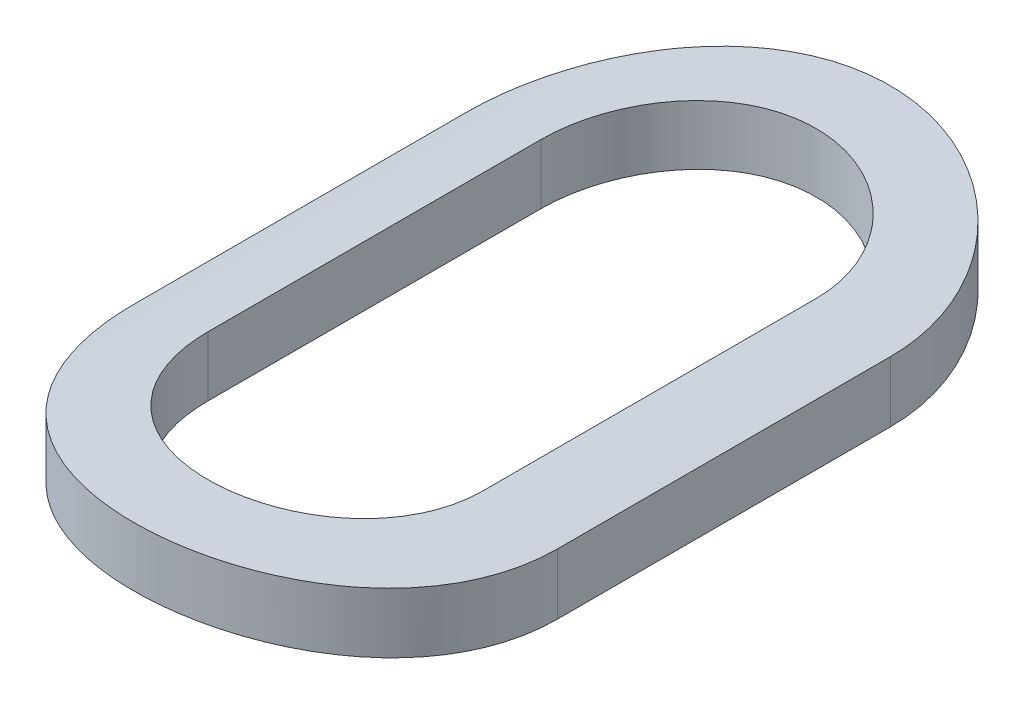
ISO-10303-21;
HEADER;
FILE_DESCRIPTION(('STEP AP214'),'2;1');
FILE_NAME('part.step','',(''),(''),'','','');
FILE_SCHEMA(('AUTOMOTIVE_DESIGN { 1 0 10303 214 1 1 1 1 }'));
ENDSEC;
DATA;
#1=APPLICATION_CONTEXT('core data for automotive mechanical design processes');
#2=APPLICATION_PROTOCOL_DEFINITION('international standard','automotive_design',2000,#1);
#3=PRODUCT_CONTEXT('',#1,'mechanical');
#4=PRODUCT('Part','Part','',(#3));
#5=PRODUCT_RELATED_PRODUCT_CATEGORY('part','',(#4));
#6=PRODUCT_DEFINITION_FORMATION('','',#4);
#7=PRODUCT_DEFINITION_CONTEXT('part definition',#1,'design');
#8=PRODUCT_DEFINITION('design','',#6,#7);
#9=PRODUCT_DEFINITION_SHAPE('','',#8);
#10=(LENGTH_UNIT() NAMED_UNIT(*) SI_UNIT(.MILLI.,.METRE.));
#11=(NAMED_UNIT(*) PLANE_ANGLE_UNIT() SI_UNIT($,.RADIAN.));
#12=(NAMED_UNIT(*) SI_UNIT($,.STERADIAN.) SOLID_ANGLE_UNIT());
#13=UNCERTAINTY_MEASURE_WITH_UNIT(LENGTH_MEASURE(1.E-05),#10,'distance_accuracy_value','');
#14=(GEOMETRIC_REPRESENTATION_CONTEXT(3) GLOBAL_UNCERTAINTY_ASSIGNED_CONTEXT((#13)) GLOBAL_UNIT_ASSIGNED_CONTEXT((#10,
#11,#12)) REPRESENTATION_CONTEXT('',''));
#15=CARTESIAN_POINT('',(0.,0.,0.));
#16=DIRECTION('',(0.,0.,1.));
#17=DIRECTION('',(1.,0.,0.));
#18=AXIS2_PLACEMENT_3D('',#15,#16,#17);
#19=CARTESIAN_POINT('',(-75.4181941684126,-39.6644186635389,0.584683614855494));
#20=DIRECTION('',(0.,0.,1.));
#21=DIRECTION('',(1.,0.,0.));
#22=AXIS2_PLACEMENT_3D('',#19,#20,#21);
#23=CYLINDRICAL_SURFACE('',#22,2.00000000000003);
#24=CARTESIAN_POINT('',(-75.6966157953255,-37.6838931278118,1.52614089397216));
#25=CARTESIAN_POINT('',(-75.6966294551295,-37.6839002867788,1.51055790257619));
#26=CARTESIAN_POINT('',(-75.6953084060336,-37.6837094101403,1.49498060774954));
#27=CARTESIAN_POINT('',(-75.6900997223513,-37.682984903865,1.46428675744976));
#28=CARTESIAN_POINT('',(-75.6862150067653,-37.682451664063,1.4491696984053));
#29=CARTESIAN_POINT('',(-75.6759798910917,-37.681095325679,1.41980396078942));
#30=CARTESIAN_POINT('',(-75.6696287659323,-37.6802721418662,1.40555553900531));
#31=CARTESIAN_POINT('',(-75.6546490646654,-37.6784312018188,1.37832682417251));
#32=CARTESIAN_POINT('',(-75.6460206019817,-37.6774134552751,1.36534646801138));
#33=CARTESIAN_POINT('',(-75.6266675065483,-37.6752897558642,1.34093397913916));
#34=CARTESIAN_POINT('',(-75.6159304559895,-37.6741833046273,1.32951173265973));
#35=CARTESIAN_POINT('',(-75.5926907558505,-37.6720113462003,1.308623829781));
#36=CARTESIAN_POINT('',(-75.580187837307,-37.6709458452788,1.29915847198194));
#37=CARTESIAN_POINT('',(-75.553708465243,-37.6689706990596,1.28241807527079));
#38=CARTESIAN_POINT('',(-75.5397261782164,-37.6680617109434,1.27515217939641));
#39=CARTESIAN_POINT('',(-75.5107258272774,-37.6665076298967,1.2630759585231));
#40=CARTESIAN_POINT('',(-75.4957078713967,-37.6658625094904,1.25826537784642));
#41=CARTESIAN_POINT('',(-75.4651646944313,-37.6649123258311,1.25126591825545));
#42=CARTESIAN_POINT('',(-75.4496433779763,-37.6646050922705,1.24906030034948));
#43=CARTESIAN_POINT('',(-75.4184477239863,-37.6643578699444,1.24728143324666));
#44=CARTESIAN_POINT('',(-75.4027733901594,-37.6644178723014,1.24770812041699));
#45=CARTESIAN_POINT('',(-75.3718315278119,-37.6648966308364,1.25116854477548));
#46=CARTESIAN_POINT('',(-75.3565619335515,-37.6653128992251,1.25418420374455));
#47=CARTESIAN_POINT('',(-75.3267477544281,-37.6664546352049,1.26270862594779));
#48=CARTESIAN_POINT('',(-75.3122031819229,-37.6671801080642,1.26821743166021));
#49=CARTESIAN_POINT('',(-75.2841962757678,-37.6688630418128,1.28159072517154));
#50=CARTESIAN_POINT('',(-75.2707376908188,-37.66982126401,1.28946296396958));
#51=CARTESIAN_POINT('',(-75.2453263231457,-37.6718626513786,1.30733365677506));
#52=CARTESIAN_POINT('',(-75.233373564732,-37.6729458185666,1.31733214510205));
#53=CARTESIAN_POINT('',(-75.2112075527389,-37.6751268689559,1.33927107507362));
#54=CARTESIAN_POINT('',(-75.2010096555949,-37.676224799518,1.35122703325541));
#55=CARTESIAN_POINT('',(-75.1827599571932,-37.678302991191,1.37669276554793));
#56=CARTESIAN_POINT('',(-75.1747087848961,-37.6792832177701,1.39020299338218));
#57=CARTESIAN_POINT('',(-75.160978686353,-37.6810155063499,1.41841293060073));
#58=CARTESIAN_POINT('',(-75.1553025839182,-37.6817672964648,1.43311403122397));
#59=CARTESIAN_POINT('',(-75.1465149521259,-37.6829517101126,1.46325601699249));
#60=CARTESIAN_POINT('',(-75.1433995707512,-37.6833848129343,1.47869575386591));
#61=CARTESIAN_POINT('',(-75.1403810235822,-37.6838079660354,1.50485861165102));
#62=CARTESIAN_POINT('',(-75.1397671156949,-37.6838956949834,1.5155021196223));
#63=CARTESIAN_POINT('',(-75.1397725414866,-37.6838931278136,1.52614089397216));
#64=B_SPLINE_CURVE_WITH_KNOTS('',3,(#24,#25,#26,#27,#28,#29,#30,#31,#32,#33,#34,#35,#36,#37,#38,
#39,#40,#41,#42,#43,#44,#45,#46,#47,#48,#49,#50,#51,#52,#53,#54,#55,#56,#57,#58,#59,#60,#61,#62,
#63),.UNSPECIFIED.,.F.,.F.,(4,2,2,2,2,2,2,2,2,2,2,2,2,2,2,2,2,2,2,4),(0.,0.046683445205683,
0.0933138279590832,0.139957929441397,0.186599708232392,0.233524883020567,0.280457212811403,
0.327582040016522,0.374701959000845,0.421517417926936,0.468331745150025,0.514821812645198,
0.561312672268412,0.607957698215604,0.65460347711198,0.701638704811785,0.748687698077968,
0.79579247182685,0.842826256899453,0.874737605827836),.UNSPECIFIED.);
#65=CARTESIAN_POINT('',(-75.6966157953255,-37.6838931278117,1.52614089397216));
#66=VERTEX_POINT('',#65);
#67=CARTESIAN_POINT('',(-75.1397725414866,-37.6838931278136,1.52614089397216));
#68=VERTEX_POINT('',#67);
#69=EDGE_CURVE('E173',#66,#68,#64,.T.);
#70=ORIENTED_EDGE('',*,*,#69,.T.);
#71=DIRECTION('',(0.,0.,1.));
#72=VECTOR('',#71,1.);
#73=CARTESIAN_POINT('',(-75.1397725414866,-37.6838931278136,1.52614089397216));
#74=LINE('',#73,#72);
#75=CARTESIAN_POINT('',(-75.1397725414866,-37.6838931278136,2.19965606593906));
#76=VERTEX_POINT('',#75);
#77=EDGE_CURVE('E111',#76,#68,#74,.F.);
#78=ORIENTED_EDGE('',*,*,#77,.F.);
#79=CARTESIAN_POINT('',(-75.1397725414866,-37.6838931278136,2.19965606593906));
#80=CARTESIAN_POINT('',(-75.1397588796207,-37.6839002866824,2.21523901509953));
#81=CARTESIAN_POINT('',(-75.1410799225853,-37.6837094111274,2.23081626779047));
#82=CARTESIAN_POINT('',(-75.1462885944889,-37.6829849067766,2.26151012045989));
#83=CARTESIAN_POINT('',(-75.1501733182881,-37.6824516659645,2.27662722161692));
#84=CARTESIAN_POINT('',(-75.1604085498956,-37.6810953115339,2.30599330416705));
#85=CARTESIAN_POINT('',(-75.1667598272963,-37.680272107451,2.32024201300512));
#86=CARTESIAN_POINT('',(-75.1817396397894,-37.6784311594776,2.34747067805799));
#87=CARTESIAN_POINT('',(-75.1903679668946,-37.6774134333571,2.36045075000263));
#88=CARTESIAN_POINT('',(-75.2097197306448,-37.6752898729645,2.38486162852106));
#89=CARTESIAN_POINT('',(-75.2204553998979,-37.674183547727,2.39628269569915));
#90=CARTESIAN_POINT('',(-75.2436949315732,-37.6720115826156,2.41717105052032));
#91=CARTESIAN_POINT('',(-75.2561994511821,-37.6709459580511,2.42663760876867));
#92=CARTESIAN_POINT('',(-75.2826865812824,-37.6689701638389,2.44338334394182));
#93=CARTESIAN_POINT('',(-75.2966756305399,-37.6680607202235,2.45065241840277));
#94=CARTESIAN_POINT('',(-75.3256802616352,-37.6665069471062,2.46272636573324));
#95=CARTESIAN_POINT('',(-75.3406946165842,-37.6658623070036,2.46753412723606));
#96=CARTESIAN_POINT('',(-75.3661906867543,-37.6650687404204,2.47337812352537));
#97=CARTESIAN_POINT('',(-75.3765094630458,-37.6648261366692,2.47513790630006));
#98=CARTESIAN_POINT('',(-75.3972820582867,-37.6645010155628,2.4774879232557));
#99=CARTESIAN_POINT('',(-75.4077358788047,-37.6644185000687,2.47807814384027));
#100=CARTESIAN_POINT('',(-75.4337519183814,-37.6644189067171,2.47807702197812));
#101=CARTESIAN_POINT('',(-75.4493195582294,-37.6646021145815,2.4767692225089));
#102=CARTESIAN_POINT('',(-75.4800209223931,-37.6653153707963,2.47157324468419));
#103=CARTESIAN_POINT('',(-75.4951541758997,-37.6658457816674,2.46768236923318));
#104=CARTESIAN_POINT('',(-75.524537296991,-37.6671937576897,2.45743806412362));
#105=CARTESIAN_POINT('',(-75.5387878109929,-37.6680111097223,2.45108646174868));
#106=CARTESIAN_POINT('',(-75.5660183827943,-37.6698423970419,2.43610502344558));
#107=CARTESIAN_POINT('',(-75.5789986259308,-37.6708563035864,2.42747552055259));
#108=CARTESIAN_POINT('',(-75.6034100675533,-37.6729753872155,2.40812130142739));
#109=CARTESIAN_POINT('',(-75.6148314615178,-37.6740810774153,2.3973842743982));
#110=CARTESIAN_POINT('',(-75.6357169845139,-37.6762550992279,2.37414528489898));
#111=CARTESIAN_POINT('',(-75.6451809299362,-37.6773234273283,2.36164315704675));
#112=CARTESIAN_POINT('',(-75.6619217538811,-37.6793069555814,2.33516253507374));
#113=CARTESIAN_POINT('',(-75.6691886877188,-37.6802214513813,2.32117770377687));
#114=CARTESIAN_POINT('',(-75.6812636393248,-37.6817861316722,2.29217326491074));
#115=CARTESIAN_POINT('',(-75.6860730762994,-37.6824364686703,2.27715426027747));
#116=CARTESIAN_POINT('',(-75.691918595569,-37.6832370693846,2.25164765166141));
#117=CARTESIAN_POINT('',(-75.6936785663991,-37.6834818214154,2.24132309798971));
#118=CARTESIAN_POINT('',(-75.6960272293276,-37.6838103779396,2.22055259136692));
#119=CARTESIAN_POINT('',(-75.6966174212662,-37.6838943885239,2.21010681116455));
#120=CARTESIAN_POINT('',(-75.6966157953255,-37.6838931278118,2.19965606593906));
#121=B_SPLINE_CURVE_WITH_KNOTS('',3,(#79,#80,#81,#82,#83,#84,#85,#86,#87,#88,#89,#90,#91,#92,
#93,#94,#95,#96,#97,#98,#99,#100,#101,#102,#103,#104,#105,#106,#107,#108,#109,#110,#111,#112,
#113,#114,#115,#116,#117,#118,#119,#120),.UNSPECIFIED.,.F.,.F.,(4,2,2,2,2,2,2,2,2,2,2,2,2,2,2,2,
2,2,2,2,4),(0.,0.0466833192223591,0.0933138279618848,0.139958897647061,0.186599708214385,
0.233519721309547,0.280457212757858,0.327607317912904,0.374701959415365,0.40605073459515,
0.437399874208021,0.48403484939351,0.530718594814154,0.577367740117317,0.624010068963722,
0.670933427045885,0.717861184561648,0.764998283537731,0.812108129951289,0.843474060832563,
0.87479974958086),.UNSPECIFIED.);
#122=CARTESIAN_POINT('',(-75.6966157953255,-37.6838931278117,2.19965606593906));
#123=VERTEX_POINT('',#122);
#124=EDGE_CURVE('E118',#76,#123,#121,.T.);
#125=ORIENTED_EDGE('',*,*,#124,.T.);
#126=DIRECTION('',(0.,0.,-1.));
#127=VECTOR('',#126,1.);
#128=CARTESIAN_POINT('',(-75.6966157953255,-37.6838931278117,2.19965606593906));
#129=LINE('',#128,#127);
#130=EDGE_CURVE('E115',#66,#123,#129,.F.);
#131=ORIENTED_EDGE('',*,*,#130,.F.);
#132=EDGE_LOOP('',(#70,#78,#125,#131));
#133=FACE_BOUND('',#132,.T.);
#134=DIRECTION('',(0.,0.,1.));
#135=VECTOR('',#134,1.);
#136=CARTESIAN_POINT('',(-75.8466157953255,-37.7108437585011,1.52614085880568));
#137=LINE('',#136,#135);
#138=CARTESIAN_POINT('',(-75.8466157953255,-37.7108437585011,2.19965610042257));
#139=VERTEX_POINT('',#138);
#140=CARTESIAN_POINT('',(-75.8466157953255,-37.7108437585011,1.52614088518054));
#141=VERTEX_POINT('',#140);
#142=EDGE_CURVE('E98',#139,#141,#137,.F.);
#143=ORIENTED_EDGE('',*,*,#142,.F.);
#144=CARTESIAN_POINT('',(-74.9897725414865,-37.710843758504,2.1996560835223));
#145=CARTESIAN_POINT('',(-74.9897507874872,-37.7108609265628,2.22346462687602));
#146=CARTESIAN_POINT('',(-74.9917557491165,-37.7104089707995,2.24726069993954));
#147=CARTESIAN_POINT('',(-74.999650902421,-37.7086961520659,2.29413004413154));
#148=CARTESIAN_POINT('',(-75.0055345436485,-37.7074366530006,2.31720446531217));
#149=CARTESIAN_POINT('',(-75.0210204579143,-37.7042371635132,2.36201895786152));
#150=CARTESIAN_POINT('',(-75.0306230085622,-37.7022971222908,2.38375892947569));
#151=CARTESIAN_POINT('',(-75.0532571160442,-37.6979614029511,2.42532356760174));
#152=CARTESIAN_POINT('',(-75.0662890477629,-37.6955656750281,2.44514802439392));
#153=CARTESIAN_POINT('',(-75.0956349864136,-37.690544432848,2.48263206652445));
#154=CARTESIAN_POINT('',(-75.1119933672644,-37.6879161167228,2.50025654152804));
#155=CARTESIAN_POINT('',(-75.1474378541796,-37.6827498539249,2.53253869880141));
#156=CARTESIAN_POINT('',(-75.1665249471919,-37.6802119403665,2.54719530296686));
#157=CARTESIAN_POINT('',(-75.2071251883386,-37.6754813678396,2.57326437579633));
#158=CARTESIAN_POINT('',(-75.2286616387265,-37.6732926006761,2.58464128255465));
#159=CARTESIAN_POINT('',(-75.2733799678486,-37.6695426855915,2.60358949416117));
#160=CARTESIAN_POINT('',(-75.2965598533901,-37.6679807922026,2.61116532188668));
#161=CARTESIAN_POINT('',(-75.3362486728264,-37.6660333465672,2.620490739329));
#162=CARTESIAN_POINT('',(-75.3524990546746,-37.6654308897503,2.62333125293238));
#163=CARTESIAN_POINT('',(-75.3852287367011,-37.6646233603424,2.62712508436784));
#164=CARTESIAN_POINT('',(-75.4017080360753,-37.6644182863556,2.6280784088279));
#165=CARTESIAN_POINT('',(-75.4419623491601,-37.6644192073268,2.62807666064007));
#166=CARTESIAN_POINT('',(-75.4657447323547,-37.6648467855909,2.62609263579518));
#167=CARTESIAN_POINT('',(-75.5126388085993,-37.6665116653701,2.61821519157517));
#168=CARTESIAN_POINT('',(-75.5357498150832,-37.6677497672734,2.61231790779678));
#169=CARTESIAN_POINT('',(-75.5806103014741,-37.6708976140934,2.59680665002691));
#170=CARTESIAN_POINT('',(-75.6023612917017,-37.6728065977997,2.58719688714658));
#171=CARTESIAN_POINT('',(-75.6439403691954,-37.6770897814008,2.56454559258032));
#172=CARTESIAN_POINT('',(-75.663768588751,-37.6794639492563,2.55150429721851));
#173=CARTESIAN_POINT('',(-75.7012470539439,-37.684458088384,2.52214724432785));
#174=CARTESIAN_POINT('',(-75.7188634133386,-37.6870810031852,2.50578872494364));
#175=CARTESIAN_POINT('',(-75.75112514488,-37.6922562593745,2.47035190925136));
#176=CARTESIAN_POINT('',(-75.7657701321695,-37.6948085915837,2.45127326117166));
#177=CARTESIAN_POINT('',(-75.7918237217925,-37.6995830774688,2.41068672079407));
#178=CARTESIAN_POINT('',(-75.8031955772303,-37.7018013582123,2.38915476932303));
#179=CARTESIAN_POINT('',(-75.822140978803,-37.7056126660641,2.34443429895392));
#180=CARTESIAN_POINT('',(-75.8297170999801,-37.7072061168997,2.32124691534171));
#181=CARTESIAN_POINT('',(-75.8390384702135,-37.7091936050441,2.28155055938063));
#182=CARTESIAN_POINT('',(-75.8418763753409,-37.7098087541299,2.26530087047552));
#183=CARTESIAN_POINT('',(-75.8456657770817,-37.7106354008836,2.23258885983498));
#184=CARTESIAN_POINT('',(-75.8466190711686,-37.7108472831656,2.21612675579508));
#185=CARTESIAN_POINT('',(-75.8466157953254,-37.7108437585011,2.19965610042257));
#186=B_SPLINE_CURVE_WITH_KNOTS('',3,(#144,#145,#146,#147,#148,#149,#150,#151,#152,#153,#154,
#155,#156,#157,#158,#159,#160,#161,#162,#163,#164,#165,#166,#167,#168,#169,#170,#171,#172,#173,
#174,#175,#176,#177,#178,#179,#180,#181,#182,#183,#184,#185),.UNSPECIFIED.,.F.,.F.,(4,2,2,2,2,2,
2,2,2,2,2,2,2,2,2,2,2,2,2,2,4),(0.,0.0713180928670392,0.142516048786507,0.21371932052547,
0.284930379125408,0.357162329816575,0.429420472492321,0.502434936871074,0.575362314580175,
0.624778709813895,0.674194931492182,0.745438669287502,0.816752866276428,0.887986407082011,
0.959215043431966,1.03142804918488,1.10365040213046,1.17665449944606,1.24960900318434,
1.29902300932562,1.34838986340816),.UNSPECIFIED.);
#187=CARTESIAN_POINT('',(-74.9897725414866,-37.710843758504,2.19965607473068));
#188=VERTEX_POINT('',#187);
#189=EDGE_CURVE('E21',#188,#139,#186,.T.);
#190=ORIENTED_EDGE('',*,*,#189,.F.);
#191=DIRECTION('',(0.,0.,-1.));
#192=VECTOR('',#191,1.);
#193=CARTESIAN_POINT('',(-74.9897725414866,-37.7108437585039,2.19965610110554));
#194=LINE('',#193,#192);
#195=CARTESIAN_POINT('',(-74.9897725414866,-37.710843758504,1.52614086018544));
#196=VERTEX_POINT('',#195);
#197=EDGE_CURVE('E85',#196,#188,#194,.F.);
#198=ORIENTED_EDGE('',*,*,#197,.F.);
#199=CARTESIAN_POINT('',(-75.8466157953255,-37.7108437585011,1.52614087638892));
#200=CARTESIAN_POINT('',(-75.8466375462383,-37.710860926741,1.50233229684094));
#201=CARTESIAN_POINT('',(-75.8446325800499,-37.710408969512,1.47853618762487));
#202=CARTESIAN_POINT('',(-75.8367374180647,-37.7086961481775,1.43166684544541));
#203=CARTESIAN_POINT('',(-75.8308537844985,-37.7074366504302,1.40859246035907));
#204=CARTESIAN_POINT('',(-75.815368021635,-37.7042371937784,1.36377842428043));
#205=CARTESIAN_POINT('',(-75.8057656791143,-37.7022971958559,1.3420388499064));
#206=CARTESIAN_POINT('',(-75.7831317253111,-37.697961493391,1.30047414373827));
#207=CARTESIAN_POINT('',(-75.7700996100327,-37.6955657218882,1.28064929389361));
#208=CARTESIAN_POINT('',(-75.7407517754949,-37.6905441715474,1.24316293410271));
#209=CARTESIAN_POINT('',(-75.7243914109984,-37.6879155738663,1.22553674701704));
#210=CARTESIAN_POINT('',(-75.6889466889083,-37.6827493250895,1.1932552363273));
#211=CARTESIAN_POINT('',(-75.6698619071841,-37.6802116882315,1.17860037615362));
#212=CARTESIAN_POINT('',(-75.6292730690832,-37.6754826039508,1.15253928629161));
#213=CARTESIAN_POINT('',(-75.6077466269489,-37.6732948919729,1.14116718492193));
#214=CARTESIAN_POINT('',(-75.5630347833723,-37.6695442824693,1.12221560182122));
#215=CARTESIAN_POINT('',(-75.5398496490479,-37.6679812846045,1.11463551098418));
#216=CARTESIAN_POINT('',(-75.4928474837554,-37.6656760727888,1.10359390922774));
#217=CARTESIAN_POINT('',(-75.4690451959955,-37.6649218707293,1.10007218422251));
#218=CARTESIAN_POINT('',(-75.4211759451345,-37.6642777190988,1.09705909600418));
#219=CARTESIAN_POINT('',(-75.397109005236,-37.6643876943566,1.09756738223824));
#220=CARTESIAN_POINT('',(-75.3498095537472,-37.6654503456381,1.1025549901147));
#221=CARTESIAN_POINT('',(-75.3265698337533,-37.6663892293919,1.10696932148018));
#222=CARTESIAN_POINT('',(-75.2811690561258,-37.6689885160083,1.11954022663475));
#223=CARTESIAN_POINT('',(-75.259008037602,-37.6706489450101,1.12769693599777));
#224=CARTESIAN_POINT('',(-75.2162115567761,-37.6745271051459,1.14757936300613));
#225=CARTESIAN_POINT('',(-75.195588024803,-37.6767487041271,1.15932997516693));
#226=CARTESIAN_POINT('',(-75.1565823887012,-37.6815051641751,1.18604774260607));
#227=CARTESIAN_POINT('',(-75.1382005116553,-37.6840400569267,1.20101522333448));
#228=CARTESIAN_POINT('',(-75.103814917621,-37.6892036380501,1.23409444378062));
#229=CARTESIAN_POINT('',(-75.0878656656595,-37.6918331894257,1.25226271237701));
#230=CARTESIAN_POINT('',(-75.0592267773114,-37.6968428248062,1.29104802299348));
#231=CARTESIAN_POINT('',(-75.0465380362665,-37.6992228401823,1.31166573536689));
#232=CARTESIAN_POINT('',(-75.0247552174354,-37.703467582625,1.35485721119513));
#233=CARTESIAN_POINT('',(-75.0156731178673,-37.7053305865483,1.37743719403201));
#234=CARTESIAN_POINT('',(-75.0014654306675,-37.7083017923708,1.42382636338776));
#235=CARTESIAN_POINT('',(-74.9963339512501,-37.7094111179819,1.4476336627376));
#236=CARTESIAN_POINT('',(-74.9909289025459,-37.7105911114106,1.48975325475553));
#237=CARTESIAN_POINT('',(-74.9897608957576,-37.7108522538644,1.50794944552493));
#238=CARTESIAN_POINT('',(-74.9897725414865,-37.7108437585039,1.52614086018544));
#239=B_SPLINE_CURVE_WITH_KNOTS('',3,(#199,#200,#201,#202,#203,#204,#205,#206,#207,#208,#209,
#210,#211,#212,#213,#214,#215,#216,#217,#218,#219,#220,#221,#222,#223,#224,#225,#226,#227,#228,
#229,#230,#231,#232,#233,#234,#235,#236,#237,#238),.UNSPECIFIED.,.F.,.F.,(4,2,2,2,2,2,2,2,2,2,2,
2,2,2,2,2,2,2,2,4),(0.,0.0713182009212712,0.142516048781537,0.213717979592351,0.284930379185427,
0.357169796743248,0.429420472648854,0.502397255709576,0.575362312831925,0.647230251696669,
0.719091939156239,0.789779986054087,0.860470593947563,0.931662403758348,1.0028614194265,
1.0754740946787,1.14810668823571,1.22097852800716,1.29374147817563,1.34829217205202),.UNSPECIFIED.);
#240=EDGE_CURVE('E99',#141,#196,#239,.T.);
#241=ORIENTED_EDGE('',*,*,#240,.F.);
#242=EDGE_LOOP('',(#143,#190,#198,#241));
#243=FACE_BOUND('',#242,.T.);
#244=ADVANCED_FACE('F17',(#133,#243),#23,.T.);
#245=CARTESIAN_POINT('',(-75.8466157953255,-36.7841716842097,1.52614085880568));
#246=DIRECTION('',(-1.,0.,0.));
#247=DIRECTION('',(0.,0.,1.));
#248=AXIS2_PLACEMENT_3D('',#245,#246,#247);
#249=PLANE('',#248);
#250=ORIENTED_EDGE('',*,*,#142,.T.);
#251=DIRECTION('',(0.,1.,0.));
#252=VECTOR('',#251,1.);
#253=CARTESIAN_POINT('',(-75.8466157953255,-36.7841716842097,1.52614087638892));
#254=LINE('',#253,#252);
#255=CARTESIAN_POINT('',(-75.8466157953255,-37.8338846131609,1.52614088518054));
#256=VERTEX_POINT('',#255);
#257=EDGE_CURVE('E168',#256,#141,#254,.T.);
#258=ORIENTED_EDGE('',*,*,#257,.F.);
#259=DIRECTION('',(0.,0.,1.));
#260=VECTOR('',#259,1.);
#261=CARTESIAN_POINT('',(-75.8466157953255,-37.8338846131609,0.584683614855494));
#262=LINE('',#261,#260);
#263=CARTESIAN_POINT('',(-75.8466157953254,-37.8338846131609,2.19965610042257));
#264=VERTEX_POINT('',#263);
#265=EDGE_CURVE('E106',#256,#264,#262,.T.);
#266=ORIENTED_EDGE('',*,*,#265,.T.);
#267=DIRECTION('',(0.,1.,0.));
#268=VECTOR('',#267,1.);
#269=CARTESIAN_POINT('',(-75.8466157953254,-36.7841716842097,2.19965610042257));
#270=LINE('',#269,#268);
#271=EDGE_CURVE('E93',#139,#264,#270,.F.);
#272=ORIENTED_EDGE('',*,*,#271,.F.);
#273=EDGE_LOOP('',(#250,#258,#266,#272));
#274=FACE_BOUND('',#273,.T.);
#275=ADVANCED_FACE('F105',(#274),#249,.T.);
#276=CARTESIAN_POINT('',(-75.418194168406,-36.7841716842097,2.19965606593906));
#277=DIRECTION('',(0.,1.,0.));
#278=DIRECTION('',(0.,0.,1.));
#279=AXIS2_PLACEMENT_3D('',#276,#277,#278);
#280=CYLINDRICAL_SURFACE('',#279,0.428421626919453);
#281=DIRECTION('',(0.,1.,0.));
#282=VECTOR('',#281,1.);
#283=CARTESIAN_POINT('',(-74.9897725414866,-36.7841716842097,2.1996560835223));
#284=LINE('',#283,#282);
#285=CARTESIAN_POINT('',(-74.9897725414866,-37.8338846131639,2.19965607473068));
#286=VERTEX_POINT('',#285);
#287=EDGE_CURVE('E95',#188,#286,#284,.F.);
#288=ORIENTED_EDGE('',*,*,#287,.F.);
#289=ORIENTED_EDGE('',*,*,#189,.T.);
#290=ORIENTED_EDGE('',*,*,#271,.T.);
#291=CARTESIAN_POINT('',(-75.8466157953254,-37.8338846131609,2.19965610042257));
#292=CARTESIAN_POINT('',(-75.846637711794,-37.8339029304359,2.2234257485374));
#293=CARTESIAN_POINT('',(-75.8446390938469,-37.8334221121681,2.24718206833917));
#294=CARTESIAN_POINT('',(-75.8367712400927,-37.8316005664174,2.29396872735303));
#295=CARTESIAN_POINT('',(-75.8309090173249,-37.830261397095,2.31700030287303));
#296=CARTESIAN_POINT('',(-75.8154831385873,-37.8268605525461,2.36172939243429));
#297=CARTESIAN_POINT('',(-75.805919409683,-37.8247988630832,2.38342688017897));
#298=CARTESIAN_POINT('',(-75.7833800232617,-37.8201919833291,2.42491488747973));
#299=CARTESIAN_POINT('',(-75.7704038387159,-37.8176467183701,2.44470511182725));
#300=CARTESIAN_POINT('',(-75.7411566266589,-37.8123066382364,2.4821703891377));
#301=CARTESIAN_POINT('',(-75.7248354807378,-37.8095084397629,2.49980584112314));
#302=CARTESIAN_POINT('',(-75.6894641112228,-37.8040067503935,2.53211908136377));
#303=CARTESIAN_POINT('',(-75.6704129049867,-37.8013032940366,2.54679580007186));
#304=CARTESIAN_POINT('',(-75.629849394204,-37.7962579783425,2.57293384423002));
#305=CARTESIAN_POINT('',(-75.6083105678603,-37.793920790548,2.58435494780232));
#306=CARTESIAN_POINT('',(-75.5635722299153,-37.7899140702946,2.6033884308634));
#307=CARTESIAN_POINT('',(-75.5403747360887,-37.7882437423591,2.61100535098437));
#308=CARTESIAN_POINT('',(-75.5005812730639,-37.7861551063762,2.62040795116304));
#309=CARTESIAN_POINT('',(-75.4842455989693,-37.7855072523778,2.62327934807514));
#310=CARTESIAN_POINT('',(-75.4513402768667,-37.7846388332883,2.62711457182405));
#311=CARTESIAN_POINT('',(-75.4347706305882,-37.7844182650408,2.62807841275261));
#312=CARTESIAN_POINT('',(-75.3944645952933,-37.7844192339978,2.62807666231415));
#313=CARTESIAN_POINT('',(-75.370721054651,-37.7848726218248,2.6260989999838));
#314=CARTESIAN_POINT('',(-75.3239053141724,-37.7866380562427,2.6182479878641));
#315=CARTESIAN_POINT('',(-75.3008337922137,-37.7879509404904,2.61237083759641));
#316=CARTESIAN_POINT('',(-75.2560527281115,-37.7912892435697,2.59691604533843));
#317=CARTESIAN_POINT('',(-75.2343415637089,-37.7933137939047,2.58734291242393));
#318=CARTESIAN_POINT('',(-75.1928351609476,-37.7978577032156,2.56478142585569));
#319=CARTESIAN_POINT('',(-75.1730398218632,-37.8003770361569,2.55179325188352));
#320=CARTESIAN_POINT('',(-75.135582099526,-37.8056840808167,2.52253229187131));
#321=CARTESIAN_POINT('',(-75.1179576420719,-37.8084753546924,2.50621160027355));
#322=CARTESIAN_POINT('',(-75.0856702794301,-37.8139871590399,2.47085014733086));
#323=CARTESIAN_POINT('',(-75.0710077879245,-37.8167076795837,2.45180900666819));
#324=CARTESIAN_POINT('',(-75.044888042797,-37.8218057334104,2.41126060507844));
#325=CARTESIAN_POINT('',(-75.0334726598055,-37.8241786101587,2.3897257640344));
#326=CARTESIAN_POINT('',(-75.0144435137885,-37.8282594376278,2.34498465456147));
#327=CARTESIAN_POINT('',(-75.0068270760236,-37.8299678559896,2.32177957531411));
#328=CARTESIAN_POINT('',(-74.9974306136454,-37.8321049852984,2.2819812763635));
#329=CARTESIAN_POINT('',(-74.9945627659019,-37.8327682788123,2.26564926902957));
#330=CARTESIAN_POINT('',(-74.9907328242145,-37.8336598491953,2.23276633022277));
#331=CARTESIAN_POINT('',(-74.9897690709116,-37.8338885048312,2.21621560203419));
#332=CARTESIAN_POINT('',(-74.9897725414865,-37.8338846131639,2.1996560835223));
#333=B_SPLINE_CURVE_WITH_KNOTS('',3,(#291,#292,#293,#294,#295,#296,#297,#298,#299,#300,#301,
#302,#303,#304,#305,#306,#307,#308,#309,#310,#311,#312,#313,#314,#315,#316,#317,#318,#319,#320,
#321,#322,#323,#324,#325,#326,#327,#328,#329,#330,#331,#332),.UNSPECIFIED.,.F.,.F.,(4,2,2,2,2,2,
2,2,2,2,2,2,2,2,2,2,2,2,2,2,4),(0.,0.0711998516915189,0.142270819288185,0.213343187336032,
0.28442653844401,0.356665086428146,0.428929701152104,0.502051838427503,0.575086488074161,
0.624773459966298,0.674460064803168,0.745587541175326,0.816784441094149,0.887894754321366,
0.959001326844777,1.03121287628063,1.10343450416351,1.17654907288925,1.24961209060781,
1.2992877858014,1.34892017104762),.UNSPECIFIED.);
#334=EDGE_CURVE('E150',#264,#286,#333,.T.);
#335=ORIENTED_EDGE('',*,*,#334,.T.);
#336=EDGE_LOOP('',(#288,#289,#290,#335));
#337=FACE_BOUND('',#336,.T.);
#338=ADVANCED_FACE('F91',(#337),#280,.T.);
#339=CARTESIAN_POINT('',(-74.9897725414866,-36.7841716842097,2.19965610110554));
#340=DIRECTION('',(1.,0.,0.));
#341=DIRECTION('',(0.,0.,-1.));
#342=AXIS2_PLACEMENT_3D('',#339,#340,#341);
#343=PLANE('',#342);
#344=ORIENTED_EDGE('',*,*,#197,.T.);
#345=ORIENTED_EDGE('',*,*,#287,.T.);
#346=DIRECTION('',(0.,0.,1.));
#347=VECTOR('',#346,1.);
#348=CARTESIAN_POINT('',(-74.9897725414866,-37.8338846131639,0.584683614855494));
#349=LINE('',#348,#347);
#350=CARTESIAN_POINT('',(-74.9897725414866,-37.8338846131639,1.52614086018544));
#351=VERTEX_POINT('',#350);
#352=EDGE_CURVE('E149',#286,#351,#349,.F.);
#353=ORIENTED_EDGE('',*,*,#352,.T.);
#354=DIRECTION('',(0.,1.,0.));
#355=VECTOR('',#354,1.);
#356=CARTESIAN_POINT('',(-74.9897725414866,-36.7841716842097,1.52614086018544));
#357=LINE('',#356,#355);
#358=EDGE_CURVE('E114',#196,#351,#357,.F.);
#359=ORIENTED_EDGE('',*,*,#358,.F.);
#360=EDGE_LOOP('',(#344,#345,#353,#359));
#361=FACE_BOUND('',#360,.T.);
#362=ADVANCED_FACE('F161',(#361),#343,.T.);
#363=CARTESIAN_POINT('',(-75.418194168406,-36.7841716842097,1.52614089397216));
#364=DIRECTION('',(0.,1.,0.));
#365=DIRECTION('',(0.,0.,1.));
#366=AXIS2_PLACEMENT_3D('',#363,#364,#365);
#367=CYLINDRICAL_SURFACE('',#366,0.428421626919453);
#368=ORIENTED_EDGE('',*,*,#358,.T.);
#369=CARTESIAN_POINT('',(-74.9897725414866,-37.8338846131639,1.52614086018544));
#370=CARTESIAN_POINT('',(-74.9897506280449,-37.8339029306288,1.50237118199599));
#371=CARTESIAN_POINT('',(-74.9917492494855,-37.8334221110613,1.47861483213106));
#372=CARTESIAN_POINT('',(-74.9996171098605,-37.8316005630049,1.43182817477012));
#373=CARTESIAN_POINT('',(-75.0054793259795,-37.8302613948483,1.40879662924099));
#374=CARTESIAN_POINT('',(-75.0209050590588,-37.8268605840483,1.36406797997596));
#375=CARTESIAN_POINT('',(-75.0304685855066,-37.824798939553,1.3423708796608));
#376=CARTESIAN_POINT('',(-75.0530078220031,-37.8201920773174,1.30088280615081));
#377=CARTESIAN_POINT('',(-75.0659841846185,-37.8176467671214,1.28109219848531));
#378=CARTESIAN_POINT('',(-75.0952332581852,-37.8123063642183,1.24362463976059));
#379=CARTESIAN_POINT('',(-75.1115563556826,-37.8095078702986,1.22598749913628));
#380=CARTESIAN_POINT('',(-75.146927954892,-37.8040061954296,1.19367489444236));
#381=CARTESIAN_POINT('',(-75.1659768843553,-37.8013030295228,1.17899989607984));
#382=CARTESIAN_POINT('',(-75.20652911573,-37.7962592854266,1.15286977940096));
#383=CARTESIAN_POINT('',(-75.2280580268001,-37.7939232140904,1.14145345961119));
#384=CARTESIAN_POINT('',(-75.2727899046752,-37.789915763612,1.12241663504961));
#385=CARTESIAN_POINT('',(-75.2959925798783,-37.7882442690165,1.11479547090847));
#386=CARTESIAN_POINT('',(-75.342997083492,-37.7857782913354,1.10369120081917));
#387=CARTESIAN_POINT('',(-75.3667820957526,-37.7849694264943,1.100140160278));
#388=CARTESIAN_POINT('',(-75.4146236265043,-37.7842699284381,1.09706427808082));
#389=CARTESIAN_POINT('',(-75.4386801172991,-37.7843792023855,1.09753902935715));
#390=CARTESIAN_POINT('',(-75.4859114780833,-37.7854927931288,1.10245129597933));
#391=CARTESIAN_POINT('',(-75.5090944249684,-37.7864805427984,1.10681546416737));
#392=CARTESIAN_POINT('',(-75.5543897592241,-37.7892210984573,1.11926547788094));
#393=CARTESIAN_POINT('',(-75.5765021043123,-37.7909739346359,1.12735147026445));
#394=CARTESIAN_POINT('',(-75.6192297537439,-37.7950740223035,1.14707902705225));
#395=CARTESIAN_POINT('',(-75.6398319644299,-37.7974258255652,1.15874796587118));
#396=CARTESIAN_POINT('',(-75.6788116951175,-37.8024666367991,1.18528939718972));
#397=CARTESIAN_POINT('',(-75.6971889486926,-37.8051556850763,1.20016227275185));
#398=CARTESIAN_POINT('',(-75.7316323407319,-37.8106473883086,1.23308491451746));
#399=CARTESIAN_POINT('',(-75.7476373265574,-37.8134512384332,1.25119851068758));
#400=CARTESIAN_POINT('',(-75.7763985233433,-37.8188010567262,1.2898873663341));
#401=CARTESIAN_POINT('',(-75.7891538462573,-37.8213469542889,1.31046329644797));
#402=CARTESIAN_POINT('',(-75.8110847952055,-37.8258965985987,1.35360065905145));
#403=CARTESIAN_POINT('',(-75.8202459505,-37.8278981439733,1.37616967854666));
#404=CARTESIAN_POINT('',(-75.8346144723176,-37.8311022038516,1.42256958646562));
#405=CARTESIAN_POINT('',(-75.839827729827,-37.8323059085435,1.44639853776769));
#406=CARTESIAN_POINT('',(-75.8441949537064,-37.8333194586835,1.47971235374917));
#407=CARTESIAN_POINT('',(-75.8451030055186,-37.8335311106148,1.48898146540078));
#408=CARTESIAN_POINT('',(-75.8463127040109,-37.8338135981246,1.50754591002082));
#409=CARTESIAN_POINT('',(-75.8466153517811,-37.8338846661691,1.51684117420681));
#410=CARTESIAN_POINT('',(-75.8466157953255,-37.8338846131608,1.52614087638892));
#411=B_SPLINE_CURVE_WITH_KNOTS('',3,(#369,#370,#371,#372,#373,#374,#375,#376,#377,#378,#379,
#380,#381,#382,#383,#384,#385,#386,#387,#388,#389,#390,#391,#392,#393,#394,#395,#396,#397,#398,
#399,#400,#401,#402,#403,#404,#405,#406,#407,#408,#409,#410),.UNSPECIFIED.,.F.,.F.,(4,2,2,2,2,2,
2,2,2,2,2,2,2,2,2,2,2,2,2,2,4),(0.,0.0711999415163308,0.142270819269587,0.213341879199599,
0.284426538483166,0.356672445057084,0.428929701278484,0.502014444736365,0.575086486036392,
0.646920255962592,0.718746762508855,0.789246760729235,0.859749541019591,0.930804975521314,
1.00186891012733,1.07452836426503,1.14720765305201,1.22017662981429,1.29303650778515,
1.3209678107878,1.34885288855906),.UNSPECIFIED.);
#412=EDGE_CURVE('E142',#351,#256,#411,.T.);
#413=ORIENTED_EDGE('',*,*,#412,.T.);
#414=ORIENTED_EDGE('',*,*,#257,.T.);
#415=ORIENTED_EDGE('',*,*,#240,.T.);
#416=EDGE_LOOP('',(#368,#413,#414,#415));
#417=FACE_BOUND('',#416,.T.);
#418=ADVANCED_FACE('F155',(#417),#367,.T.);
#419=CARTESIAN_POINT('',(-75.1397725414866,-36.7841716842097,1.52614089397216));
#420=DIRECTION('',(-1.,0.,0.));
#421=DIRECTION('',(0.,0.,1.));
#422=AXIS2_PLACEMENT_3D('',#419,#420,#421);
#423=PLANE('',#422);
#424=ORIENTED_EDGE('',*,*,#77,.T.);
#425=DIRECTION('',(0.,1.,0.));
#426=VECTOR('',#425,1.);
#427=CARTESIAN_POINT('',(-75.1397725414866,-36.7841716842097,1.52614089397216));
#428=LINE('',#427,#426);
#429=CARTESIAN_POINT('',(-75.1397725414866,-37.8051496142456,1.52614089397216));
#430=VERTEX_POINT('',#429);
#431=EDGE_CURVE('E211',#68,#430,#428,.F.);
#432=ORIENTED_EDGE('',*,*,#431,.T.);
#433=DIRECTION('',(0.,0.,1.));
#434=VECTOR('',#433,1.);
#435=CARTESIAN_POINT('',(-75.1397725414866,-37.8051496142456,0.584683614855494));
#436=LINE('',#435,#434);
#437=CARTESIAN_POINT('',(-75.1397725414866,-37.8051496142456,2.19965606593906));
#438=VERTEX_POINT('',#437);
#439=EDGE_CURVE('E148',#430,#438,#436,.T.);
#440=ORIENTED_EDGE('',*,*,#439,.T.);
#441=DIRECTION('',(0.,1.,0.));
#442=VECTOR('',#441,1.);
#443=CARTESIAN_POINT('',(-75.1397725414866,-36.7841716842097,2.19965606593906));
#444=LINE('',#443,#442);
#445=EDGE_CURVE('E113',#438,#76,#444,.T.);
#446=ORIENTED_EDGE('',*,*,#445,.T.);
#447=EDGE_LOOP('',(#424,#432,#440,#446));
#448=FACE_BOUND('',#447,.T.);
#449=ADVANCED_FACE('F160',(#448),#423,.T.);
#450=CARTESIAN_POINT('',(-75.418194168406,-36.7841716842097,2.19965606593906));
#451=DIRECTION('',(0.,1.,0.));
#452=DIRECTION('',(0.,0.,1.));
#453=AXIS2_PLACEMENT_3D('',#450,#451,#452);
#454=CYLINDRICAL_SURFACE('',#453,0.278421626919453);
#455=CARTESIAN_POINT('',(-75.1397725414866,-37.8051496142456,2.19965606593906));
#456=CARTESIAN_POINT('',(-75.1397588330092,-37.8051572393933,2.21522842836191));
#457=CARTESIAN_POINT('',(-75.1410781373833,-37.8049541814097,2.23079486495931));
#458=CARTESIAN_POINT('',(-75.14627931797,-37.8041835505056,2.26146620897416));
#459=CARTESIAN_POINT('',(-75.1501581564234,-37.8036164097151,2.27657164132231));
#460=CARTESIAN_POINT('',(-75.1603768771361,-37.8021740062354,2.30591448750943));
#461=CARTESIAN_POINT('',(-75.166717471805,-37.8012986543595,2.32015164869746));
#462=CARTESIAN_POINT('',(-75.1816712052972,-37.7993412078702,2.34735955381955));
#463=CARTESIAN_POINT('',(-75.1902841809336,-37.7982591281042,2.36033038860092));
#464=CARTESIAN_POINT('',(-75.2096089894581,-37.7960003153417,2.38473655627331));
#465=CARTESIAN_POINT('',(-75.2203346707359,-37.7948229897704,2.39616087007007));
#466=CARTESIAN_POINT('',(-75.2435547046198,-37.792511360754,2.41705817533304));
#467=CARTESIAN_POINT('',(-75.2560497126364,-37.7913770734499,2.42653044049624));
#468=CARTESIAN_POINT('',(-75.2825272162585,-37.7892729092744,2.44329500871217));
#469=CARTESIAN_POINT('',(-75.2965169561047,-37.7883038982061,2.45057597595414));
#470=CARTESIAN_POINT('',(-75.3255270420292,-37.7866479076244,2.46267283957948));
#471=CARTESIAN_POINT('',(-75.3405461547438,-37.7859605972498,2.46749162947406));
#472=CARTESIAN_POINT('',(-75.3660707113774,-37.7851134497992,2.47335621631245));
#473=CARTESIAN_POINT('',(-75.3764127181326,-37.7848541661655,2.47512417512296));
#474=CARTESIAN_POINT('',(-75.3972330492243,-37.7845066853932,2.4774851457269));
#475=CARTESIAN_POINT('',(-75.4077113749623,-37.784418490015,2.47807814543068));
#476=CARTESIAN_POINT('',(-75.4337410997909,-37.7844189208898,2.47807702165789));
#477=CARTESIAN_POINT('',(-75.4492978581502,-37.7846135507162,2.47677101809327));
#478=CARTESIAN_POINT('',(-75.4799772645783,-37.7853712857241,2.47158251034113));
#479=CARTESIAN_POINT('',(-75.4950994441962,-37.7859347740276,2.46769732717911));
#480=CARTESIAN_POINT('',(-75.524460268207,-37.7873668725884,2.45746902098007));
#481=CARTESIAN_POINT('',(-75.5386995924642,-37.7882352445407,2.45112781723431));
#482=CARTESIAN_POINT('',(-75.5659098557449,-37.7901811147853,2.43617186032077));
#483=CARTESIAN_POINT('',(-75.5788809698561,-37.7912585841483,2.42755742160264));
#484=CARTESIAN_POINT('',(-75.6032874058739,-37.7935119466686,2.40822989293331));
#485=CARTESIAN_POINT('',(-75.6147116951467,-37.7946884587699,2.39750294268114));
#486=CARTESIAN_POINT('',(-75.6356055290534,-37.7970025136327,2.37428373266147));
#487=CARTESIAN_POINT('',(-75.6450748847947,-37.7981400526197,2.36179130250326));
#488=CARTESIAN_POINT('',(-75.6618342447829,-37.8002535759068,2.3353204261618));
#489=CARTESIAN_POINT('',(-75.6691130113274,-37.8012287160695,2.32133479987346));
#490=CARTESIAN_POINT('',(-75.6812107085943,-37.8028978267703,2.29232478758513));
#491=CARTESIAN_POINT('',(-75.6860310809292,-37.8035919620415,2.27730101624088));
#492=CARTESIAN_POINT('',(-75.691896921218,-37.8044475770157,2.25176632009417));
#493=CARTESIAN_POINT('',(-75.6936649449693,-37.8047094639056,2.24141896723069));
#494=CARTESIAN_POINT('',(-75.6960244815537,-37.8050610563491,2.2206013234097));
#495=CARTESIAN_POINT('',(-75.6966174664384,-37.8051509773313,2.21013120282279));
#496=CARTESIAN_POINT('',(-75.6966157953255,-37.8051496142436,2.19965606593906));
#497=B_SPLINE_CURVE_WITH_KNOTS('',3,(#455,#456,#457,#458,#459,#460,#461,#462,#463,#464,#465,
#466,#467,#468,#469,#470,#471,#472,#473,#474,#475,#476,#477,#478,#479,#480,#481,#482,#483,#484,
#485,#486,#487,#488,#489,#490,#491,#492,#493,#494,#495,#496),.UNSPECIFIED.,.F.,.F.,(4,2,2,2,2,2,
2,2,2,2,2,2,2,2,2,2,2,2,2,2,4),(0.,0.0466511443935809,0.0932470206513256,0.139856391389441,
0.186462415871309,0.233384759868191,0.280324530967991,0.32750310992918,0.374626117122588,
0.406048286567932,0.437470779327231,0.484073179873506,0.530724061879942,0.577338561226545,
0.623946615908495,0.670871318505099,0.717800553014144,0.764966583880329,0.812104924496342,
0.843542947120708,0.874941560220148),.UNSPECIFIED.);
#498=CARTESIAN_POINT('',(-75.6966157953255,-37.8051496142436,2.19965606593906));
#499=VERTEX_POINT('',#498);
#500=EDGE_CURVE('E125',#438,#499,#497,.T.);
#501=ORIENTED_EDGE('',*,*,#500,.T.);
#502=DIRECTION('',(0.,1.,0.));
#503=VECTOR('',#502,1.);
#504=CARTESIAN_POINT('',(-75.6966157953255,-36.7841716842097,2.19965606593906));
#505=LINE('',#504,#503);
#506=EDGE_CURVE('E117',#123,#499,#505,.F.);
#507=ORIENTED_EDGE('',*,*,#506,.F.);
#508=ORIENTED_EDGE('',*,*,#124,.F.);
#509=ORIENTED_EDGE('',*,*,#445,.F.);
#510=EDGE_LOOP('',(#501,#507,#508,#509));
#511=FACE_BOUND('',#510,.T.);
#512=ADVANCED_FACE('F177',(#511),#454,.F.);
#513=CARTESIAN_POINT('',(-75.6966157953255,-36.7841716842097,2.19965606593906));
#514=DIRECTION('',(1.,0.,0.));
#515=DIRECTION('',(0.,0.,-1.));
#516=AXIS2_PLACEMENT_3D('',#513,#514,#515);
#517=PLANE('',#516);
#518=ORIENTED_EDGE('',*,*,#130,.T.);
#519=ORIENTED_EDGE('',*,*,#506,.T.);
#520=DIRECTION('',(0.,0.,1.));
#521=VECTOR('',#520,1.);
#522=CARTESIAN_POINT('',(-75.6966157953255,-37.8051496142436,0.584683614855494));
#523=LINE('',#522,#521);
#524=CARTESIAN_POINT('',(-75.6966157953255,-37.8051496142436,1.52614089397216));
#525=VERTEX_POINT('',#524);
#526=EDGE_CURVE('E31',#499,#525,#523,.F.);
#527=ORIENTED_EDGE('',*,*,#526,.T.);
#528=DIRECTION('',(0.,1.,0.));
#529=VECTOR('',#528,1.);
#530=CARTESIAN_POINT('',(-75.6966157953255,-36.7841716842097,1.52614089397216));
#531=LINE('',#530,#529);
#532=EDGE_CURVE('E39',#525,#66,#531,.T.);
#533=ORIENTED_EDGE('',*,*,#532,.T.);
#534=EDGE_LOOP('',(#518,#519,#527,#533));
#535=FACE_BOUND('',#534,.T.);
#536=ADVANCED_FACE('F180',(#535),#517,.T.);
#537=CARTESIAN_POINT('',(-75.418194168406,-36.7841716842097,1.52614089397216));
#538=DIRECTION('',(0.,1.,0.));
#539=DIRECTION('',(0.,0.,1.));
#540=AXIS2_PLACEMENT_3D('',#537,#538,#539);
#541=CYLINDRICAL_SURFACE('',#540,0.278421626919453);
#542=ORIENTED_EDGE('',*,*,#431,.F.);
#543=ORIENTED_EDGE('',*,*,#69,.F.);
#544=ORIENTED_EDGE('',*,*,#532,.F.);
#545=CARTESIAN_POINT('',(-75.6966157953255,-37.8051496142436,1.52614089397216));
#546=CARTESIAN_POINT('',(-75.6966295017461,-37.8051572394935,1.51056849120911));
#547=CARTESIAN_POINT('',(-75.6953101915637,-37.804954180407,1.49500201436457));
#548=CARTESIAN_POINT('',(-75.6901089998248,-37.8041835475444,1.46433067261257));
#549=CARTESIAN_POINT('',(-75.6862301692557,-37.8036164077798,1.44922528048699));
#550=CARTESIAN_POINT('',(-75.6760115627182,-37.8021740211403,1.41988277442119));
#551=CARTESIAN_POINT('',(-75.669671118603,-37.8012986906204,1.4056458974339));
#552=CARTESIAN_POINT('',(-75.6547174952108,-37.7993412524792,1.37843794308479));
#553=CARTESIAN_POINT('',(-75.6461043856177,-37.7982591511981,1.36546682692919));
#554=CARTESIAN_POINT('',(-75.6267782551289,-37.7960001914573,1.34105905898449));
#555=CARTESIAN_POINT('',(-75.6160512014829,-37.7948227325687,1.32963357228795));
#556=CARTESIAN_POINT('',(-75.5928310006519,-37.7925111105821,1.30873671587939));
#557=CARTESIAN_POINT('',(-75.5803375841267,-37.7913769541206,1.29926564472501));
#558=CARTESIAN_POINT('',(-75.5538678054451,-37.7892734773676,1.28250640100041));
#559=CARTESIAN_POINT('',(-75.5398848034731,-37.7883049499175,1.27522860738963));
#560=CARTESIAN_POINT('',(-75.5108789919214,-37.7866486332367,1.26312947793718));
#561=CARTESIAN_POINT('',(-75.4958562963909,-37.7859608132707,1.25830787314715));
#562=CARTESIAN_POINT('',(-75.4653131808886,-37.7849476053345,1.25129160485299));
#563=CARTESIAN_POINT('',(-75.4497971960947,-37.7846196076601,1.24907801723491));
#564=CARTESIAN_POINT('',(-75.4186104105638,-37.7843540561494,1.24728185559383));
#565=CARTESIAN_POINT('',(-75.4029396145317,-37.7844164904835,1.24769920185717));
#566=CARTESIAN_POINT('',(-75.3720179486906,-37.7849226954768,1.25113820409134));
#567=CARTESIAN_POINT('',(-75.356764750729,-37.7853634744952,1.25413942941615));
#568=CARTESIAN_POINT('',(-75.3269809824389,-37.7865735031483,1.26262891808113));
#569=CARTESIAN_POINT('',(-75.3124504260496,-37.7873427591163,1.2681172293746));
#570=CARTESIAN_POINT('',(-75.2844621034007,-37.78912846882,1.28144619761677));
#571=CARTESIAN_POINT('',(-75.2710085234703,-37.7901458303554,1.28929551851729));
#572=CARTESIAN_POINT('',(-75.2456023250013,-37.7923142655695,1.30711702578603));
#573=CARTESIAN_POINT('',(-75.2336497433866,-37.7934653425363,1.31708926436082));
#574=CARTESIAN_POINT('',(-75.2114652484142,-37.7957857527411,1.33898601139107));
#575=CARTESIAN_POINT('',(-75.2012506893821,-37.7969551556588,1.3509281023634));
#576=CARTESIAN_POINT('',(-75.1829651439955,-37.7991700170537,1.37636993756553));
#577=CARTESIAN_POINT('',(-75.1748947802461,-37.8002154394823,1.3898701325898));
#578=CARTESIAN_POINT('',(-75.1611235561072,-37.8020645134793,1.41806707736064));
#579=CARTESIAN_POINT('',(-75.1554258437071,-37.8028678434563,1.43276538603895));
#580=CARTESIAN_POINT('',(-75.1465955603943,-37.8041349922384,1.46290735725915));
#581=CARTESIAN_POINT('',(-75.1434591426964,-37.8045993200763,1.47834986501401));
#582=CARTESIAN_POINT('',(-75.1403941988221,-37.8050569284809,1.5046297239216));
#583=CARTESIAN_POINT('',(-75.1397669307012,-37.8051524387933,1.51538762730936));
#584=CARTESIAN_POINT('',(-75.1397725414866,-37.8051496142456,1.52614089397216));
#585=B_SPLINE_CURVE_WITH_KNOTS('',3,(#545,#546,#547,#548,#549,#550,#551,#552,#553,#554,#555,
#556,#557,#558,#559,#560,#561,#562,#563,#564,#565,#566,#567,#568,#569,#570,#571,#572,#573,#574,
#575,#576,#577,#578,#579,#580,#581,#582,#583,#584),.UNSPECIFIED.,.F.,.F.,(4,2,2,2,2,2,2,2,2,2,2,
2,2,2,2,2,2,2,2,4),(0.,0.0466512647283655,0.0932470206483805,0.139855432735405,
0.186462415891474,0.233389891773786,0.280324531026685,0.327477905993216,0.374626116637686,
0.421430064459369,0.468232594193199,0.51466842145066,0.561105144071968,0.607714393845447,
0.654324789960879,0.701376291565923,0.748441440513902,0.79556883717771,0.842625322780805,
0.874879345791475),.UNSPECIFIED.);
#586=EDGE_CURVE('E11',#525,#430,#585,.T.);
#587=ORIENTED_EDGE('',*,*,#586,.T.);
#588=EDGE_LOOP('',(#542,#543,#544,#587));
#589=FACE_BOUND('',#588,.T.);
#590=ADVANCED_FACE('F131',(#589),#541,.F.);
#591=CARTESIAN_POINT('',(-75.4181941684126,-39.6644186635389,0.584683614855494));
#592=DIRECTION('',(0.,0.,1.));
#593=DIRECTION('',(1.,0.,0.));
#594=AXIS2_PLACEMENT_3D('',#591,#592,#593);
#595=CYLINDRICAL_SURFACE('',#594,1.88000000000003);
#596=ORIENTED_EDGE('',*,*,#526,.F.);
#597=ORIENTED_EDGE('',*,*,#500,.F.);
#598=ORIENTED_EDGE('',*,*,#439,.F.);
#599=ORIENTED_EDGE('',*,*,#586,.F.);
#600=EDGE_LOOP('',(#596,#597,#598,#599));
#601=FACE_BOUND('',#600,.T.);
#602=ORIENTED_EDGE('',*,*,#352,.F.);
#603=ORIENTED_EDGE('',*,*,#334,.F.);
#604=ORIENTED_EDGE('',*,*,#265,.F.);
#605=ORIENTED_EDGE('',*,*,#412,.F.);
#606=EDGE_LOOP('',(#602,#603,#604,#605));
#607=FACE_BOUND('',#606,.T.);
#608=ADVANCED_FACE('F134',(#601,#607),#595,.F.);
#609=CLOSED_SHELL('',(#244,#275,#338,#362,#418,#449,#512,#536,#590,#608));
#610=MANIFOLD_SOLID_BREP('B1',#609);
#611=ADVANCED_BREP_SHAPE_REPRESENTATION('',(#18,#610),#14);
#612=SHAPE_DEFINITION_REPRESENTATION(#9,#611);
ENDSEC;
END-ISO-10303-21;
